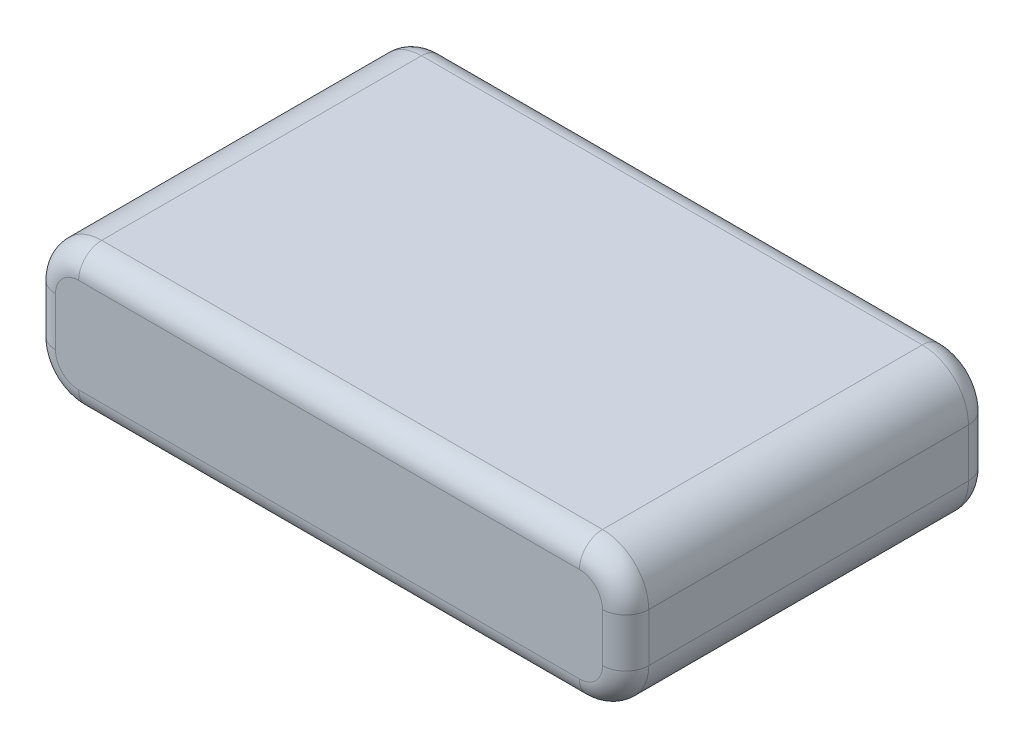
ISO-10303-21;
HEADER;
FILE_DESCRIPTION(('STEP AP214'),'2;1');
FILE_NAME('part.step','',(''),(''),'','','');
FILE_SCHEMA(('AUTOMOTIVE_DESIGN { 1 0 10303 214 1 1 1 1 }'));
ENDSEC;
DATA;
#1=APPLICATION_CONTEXT('core data for automotive mechanical design processes');
#2=APPLICATION_PROTOCOL_DEFINITION('international standard','automotive_design',2000,#1);
#3=PRODUCT_CONTEXT('',#1,'mechanical');
#4=PRODUCT('Part','Part','',(#3));
#5=PRODUCT_RELATED_PRODUCT_CATEGORY('part','',(#4));
#6=PRODUCT_DEFINITION_FORMATION('','',#4);
#7=PRODUCT_DEFINITION_CONTEXT('part definition',#1,'design');
#8=PRODUCT_DEFINITION('design','',#6,#7);
#9=PRODUCT_DEFINITION_SHAPE('','',#8);
#10=(LENGTH_UNIT() NAMED_UNIT(*) SI_UNIT(.MILLI.,.METRE.));
#11=(NAMED_UNIT(*) PLANE_ANGLE_UNIT() SI_UNIT($,.RADIAN.));
#12=(NAMED_UNIT(*) SI_UNIT($,.STERADIAN.) SOLID_ANGLE_UNIT());
#13=UNCERTAINTY_MEASURE_WITH_UNIT(LENGTH_MEASURE(1.E-05),#10,'distance_accuracy_value','');
#14=(GEOMETRIC_REPRESENTATION_CONTEXT(3) GLOBAL_UNCERTAINTY_ASSIGNED_CONTEXT((#13)) GLOBAL_UNIT_ASSIGNED_CONTEXT((#10,
#11,#12)) REPRESENTATION_CONTEXT('',''));
#15=CARTESIAN_POINT('',(0.,0.,0.));
#16=DIRECTION('',(0.,0.,1.));
#17=DIRECTION('',(1.,0.,0.));
#18=AXIS2_PLACEMENT_3D('',#15,#16,#17);
#19=CARTESIAN_POINT('',(19.25,9.15,-11.875));
#20=DIRECTION('',(-1.,0.,0.));
#21=DIRECTION('',(0.,0.,1.));
#22=AXIS2_PLACEMENT_3D('',#19,#20,#21);
#23=PLANE('',#22);
#24=DIRECTION('',(0.,0.,-1.));
#25=VECTOR('',#24,1.);
#26=CARTESIAN_POINT('',(19.25,3.,-11.875));
#27=LINE('',#26,#25);
#28=CARTESIAN_POINT('',(19.25,3.,10.375));
#29=VERTEX_POINT('',#28);
#30=CARTESIAN_POINT('',(19.25,3.,-10.375));
#31=VERTEX_POINT('',#30);
#32=EDGE_CURVE('E169',#29,#31,#27,.T.);
#33=ORIENTED_EDGE('',*,*,#32,.T.);
#34=DIRECTION('',(0.,-1.,0.));
#35=VECTOR('',#34,1.);
#36=CARTESIAN_POINT('',(19.25,9.15,-10.375));
#37=LINE('',#36,#35);
#38=CARTESIAN_POINT('',(19.25,6.15,-10.375));
#39=VERTEX_POINT('',#38);
#40=EDGE_CURVE('E185',#31,#39,#37,.F.);
#41=ORIENTED_EDGE('',*,*,#40,.T.);
#42=DIRECTION('',(0.,0.,-1.));
#43=VECTOR('',#42,1.);
#44=CARTESIAN_POINT('',(19.25,6.15,11.875));
#45=LINE('',#44,#43);
#46=CARTESIAN_POINT('',(19.25,6.15,10.375));
#47=VERTEX_POINT('',#46);
#48=EDGE_CURVE('E298',#39,#47,#45,.F.);
#49=ORIENTED_EDGE('',*,*,#48,.T.);
#50=DIRECTION('',(0.,-1.,0.));
#51=VECTOR('',#50,1.);
#52=CARTESIAN_POINT('',(19.25,9.15,10.375));
#53=LINE('',#52,#51);
#54=EDGE_CURVE('E183',#47,#29,#53,.T.);
#55=ORIENTED_EDGE('',*,*,#54,.T.);
#56=EDGE_LOOP('',(#33,#41,#49,#55));
#57=FACE_BOUND('',#56,.T.);
#58=ADVANCED_FACE('F36',(#57),#23,.F.);
#59=CARTESIAN_POINT('',(-19.25,9.15,-11.875));
#60=DIRECTION('',(0.,0.,1.));
#61=DIRECTION('',(1.,0.,0.));
#62=AXIS2_PLACEMENT_3D('',#59,#60,#61);
#63=PLANE('',#62);
#64=DIRECTION('',(0.,-1.,0.));
#65=VECTOR('',#64,1.);
#66=CARTESIAN_POINT('',(17.75,9.15,-11.875));
#67=LINE('',#66,#65);
#68=CARTESIAN_POINT('',(17.75,6.15,-11.875));
#69=VERTEX_POINT('',#68);
#70=CARTESIAN_POINT('',(17.75,3.,-11.875));
#71=VERTEX_POINT('',#70);
#72=EDGE_CURVE('E173',#69,#71,#67,.T.);
#73=ORIENTED_EDGE('',*,*,#72,.T.);
#74=CARTESIAN_POINT('',(16.25,3.,-11.875));
#75=DIRECTION('',(0.,0.,1.));
#76=DIRECTION('',(1.,0.,0.));
#77=AXIS2_PLACEMENT_3D('',#74,#75,#76);
#78=CIRCLE('',#77,1.5);
#79=CARTESIAN_POINT('',(16.25,1.5,-11.875));
#80=VERTEX_POINT('',#79);
#81=EDGE_CURVE('E154',#71,#80,#78,.F.);
#82=ORIENTED_EDGE('',*,*,#81,.T.);
#83=DIRECTION('',(-1.,0.,0.));
#84=VECTOR('',#83,1.);
#85=CARTESIAN_POINT('',(-19.25,1.5,-11.875));
#86=LINE('',#85,#84);
#87=CARTESIAN_POINT('',(-16.25,1.5,-11.875));
#88=VERTEX_POINT('',#87);
#89=EDGE_CURVE('E162',#80,#88,#86,.T.);
#90=ORIENTED_EDGE('',*,*,#89,.T.);
#91=CARTESIAN_POINT('',(-16.25,3.,-11.875));
#92=DIRECTION('',(0.,0.,1.));
#93=DIRECTION('',(1.,0.,0.));
#94=AXIS2_PLACEMENT_3D('',#91,#92,#93);
#95=CIRCLE('',#94,1.5);
#96=CARTESIAN_POINT('',(-17.75,3.,-11.875));
#97=VERTEX_POINT('',#96);
#98=EDGE_CURVE('E168',#88,#97,#95,.F.);
#99=ORIENTED_EDGE('',*,*,#98,.T.);
#100=DIRECTION('',(0.,-1.,0.));
#101=VECTOR('',#100,1.);
#102=CARTESIAN_POINT('',(-17.75,9.15,-11.875));
#103=LINE('',#102,#101);
#104=CARTESIAN_POINT('',(-17.75,6.15,-11.875));
#105=VERTEX_POINT('',#104);
#106=EDGE_CURVE('E303',#97,#105,#103,.F.);
#107=ORIENTED_EDGE('',*,*,#106,.T.);
#108=CARTESIAN_POINT('',(-16.25,6.15,-11.875));
#109=DIRECTION('',(0.,0.,1.));
#110=DIRECTION('',(1.,0.,0.));
#111=AXIS2_PLACEMENT_3D('',#108,#109,#110);
#112=CIRCLE('',#111,1.5);
#113=CARTESIAN_POINT('',(-16.25,7.65,-11.875));
#114=VERTEX_POINT('',#113);
#115=EDGE_CURVE('E305',#105,#114,#112,.F.);
#116=ORIENTED_EDGE('',*,*,#115,.T.);
#117=DIRECTION('',(-1.,0.,0.));
#118=VECTOR('',#117,1.);
#119=CARTESIAN_POINT('',(16.25,7.65,-11.875));
#120=LINE('',#119,#118);
#121=CARTESIAN_POINT('',(16.25,7.65,-11.875));
#122=VERTEX_POINT('',#121);
#123=EDGE_CURVE('E307',#114,#122,#120,.F.);
#124=ORIENTED_EDGE('',*,*,#123,.T.);
#125=CARTESIAN_POINT('',(16.25,6.15,-11.875));
#126=DIRECTION('',(0.,0.,1.));
#127=DIRECTION('',(1.,0.,0.));
#128=AXIS2_PLACEMENT_3D('',#125,#126,#127);
#129=CIRCLE('',#128,1.5);
#130=EDGE_CURVE('E178',#122,#69,#129,.F.);
#131=ORIENTED_EDGE('',*,*,#130,.T.);
#132=EDGE_LOOP('',(#73,#82,#90,#99,#107,#116,#124,#131));
#133=FACE_BOUND('',#132,.T.);
#134=ADVANCED_FACE('F171',(#133),#63,.F.);
#135=CARTESIAN_POINT('',(-19.25,9.15,-11.875));
#136=DIRECTION('',(1.,0.,0.));
#137=DIRECTION('',(0.,0.,-1.));
#138=AXIS2_PLACEMENT_3D('',#135,#136,#137);
#139=PLANE('',#138);
#140=DIRECTION('',(0.,0.,1.));
#141=VECTOR('',#140,1.);
#142=CARTESIAN_POINT('',(-19.25,6.15,-11.875));
#143=LINE('',#142,#141);
#144=CARTESIAN_POINT('',(-19.25,6.15,10.375));
#145=VERTEX_POINT('',#144);
#146=CARTESIAN_POINT('',(-19.25,6.15,-10.375));
#147=VERTEX_POINT('',#146);
#148=EDGE_CURVE('E241',#145,#147,#143,.F.);
#149=ORIENTED_EDGE('',*,*,#148,.T.);
#150=DIRECTION('',(0.,-1.,0.));
#151=VECTOR('',#150,1.);
#152=CARTESIAN_POINT('',(-19.25,9.15,-10.375));
#153=LINE('',#152,#151);
#154=CARTESIAN_POINT('',(-19.25,3.,-10.375));
#155=VERTEX_POINT('',#154);
#156=EDGE_CURVE('E202',#147,#155,#153,.T.);
#157=ORIENTED_EDGE('',*,*,#156,.T.);
#158=DIRECTION('',(0.,0.,1.));
#159=VECTOR('',#158,1.);
#160=CARTESIAN_POINT('',(-19.25,3.,-11.875));
#161=LINE('',#160,#159);
#162=CARTESIAN_POINT('',(-19.25,3.,10.375));
#163=VERTEX_POINT('',#162);
#164=EDGE_CURVE('E285',#155,#163,#161,.T.);
#165=ORIENTED_EDGE('',*,*,#164,.T.);
#166=DIRECTION('',(0.,-1.,0.));
#167=VECTOR('',#166,1.);
#168=CARTESIAN_POINT('',(-19.25,9.15,10.375));
#169=LINE('',#168,#167);
#170=EDGE_CURVE('E200',#163,#145,#169,.F.);
#171=ORIENTED_EDGE('',*,*,#170,.T.);
#172=EDGE_LOOP('',(#149,#157,#165,#171));
#173=FACE_BOUND('',#172,.T.);
#174=ADVANCED_FACE('F348',(#173),#139,.F.);
#175=CARTESIAN_POINT('',(-19.25,9.15,11.875));
#176=DIRECTION('',(0.,0.,-1.));
#177=DIRECTION('',(-1.,0.,0.));
#178=AXIS2_PLACEMENT_3D('',#175,#176,#177);
#179=PLANE('',#178);
#180=DIRECTION('',(1.,0.,0.));
#181=VECTOR('',#180,1.);
#182=CARTESIAN_POINT('',(-16.25,7.65,11.875));
#183=LINE('',#182,#181);
#184=CARTESIAN_POINT('',(16.25,7.65,11.875));
#185=VERTEX_POINT('',#184);
#186=CARTESIAN_POINT('',(-16.25,7.65,11.875));
#187=VERTEX_POINT('',#186);
#188=EDGE_CURVE('E45',#185,#187,#183,.F.);
#189=ORIENTED_EDGE('',*,*,#188,.T.);
#190=CARTESIAN_POINT('',(-16.25,6.15,11.875));
#191=DIRECTION('',(0.,0.,-1.));
#192=DIRECTION('',(-1.,0.,0.));
#193=AXIS2_PLACEMENT_3D('',#190,#191,#192);
#194=CIRCLE('',#193,1.5);
#195=CARTESIAN_POINT('',(-17.75,6.15,11.875));
#196=VERTEX_POINT('',#195);
#197=EDGE_CURVE('E11',#187,#196,#194,.F.);
#198=ORIENTED_EDGE('',*,*,#197,.T.);
#199=DIRECTION('',(0.,-1.,0.));
#200=VECTOR('',#199,1.);
#201=CARTESIAN_POINT('',(-17.75,9.15,11.875));
#202=LINE('',#201,#200);
#203=CARTESIAN_POINT('',(-17.75,3.,11.875));
#204=VERTEX_POINT('',#203);
#205=EDGE_CURVE('E212',#196,#204,#202,.T.);
#206=ORIENTED_EDGE('',*,*,#205,.T.);
#207=CARTESIAN_POINT('',(-16.25,3.,11.875));
#208=DIRECTION('',(0.,0.,-1.));
#209=DIRECTION('',(-1.,0.,0.));
#210=AXIS2_PLACEMENT_3D('',#207,#208,#209);
#211=CIRCLE('',#210,1.5);
#212=CARTESIAN_POINT('',(-16.25,1.5,11.875));
#213=VERTEX_POINT('',#212);
#214=EDGE_CURVE('E214',#204,#213,#211,.F.);
#215=ORIENTED_EDGE('',*,*,#214,.T.);
#216=DIRECTION('',(1.,0.,0.));
#217=VECTOR('',#216,1.);
#218=CARTESIAN_POINT('',(-19.25,1.5,11.875));
#219=LINE('',#218,#217);
#220=CARTESIAN_POINT('',(16.25,1.5,11.875));
#221=VERTEX_POINT('',#220);
#222=EDGE_CURVE('E216',#213,#221,#219,.T.);
#223=ORIENTED_EDGE('',*,*,#222,.T.);
#224=CARTESIAN_POINT('',(16.25,3.,11.875));
#225=DIRECTION('',(0.,0.,-1.));
#226=DIRECTION('',(-1.,0.,0.));
#227=AXIS2_PLACEMENT_3D('',#224,#225,#226);
#228=CIRCLE('',#227,1.5);
#229=CARTESIAN_POINT('',(17.75,3.,11.875));
#230=VERTEX_POINT('',#229);
#231=EDGE_CURVE('E218',#221,#230,#228,.F.);
#232=ORIENTED_EDGE('',*,*,#231,.T.);
#233=DIRECTION('',(0.,-1.,0.));
#234=VECTOR('',#233,1.);
#235=CARTESIAN_POINT('',(17.75,9.15,11.875));
#236=LINE('',#235,#234);
#237=CARTESIAN_POINT('',(17.75,6.15,11.875));
#238=VERTEX_POINT('',#237);
#239=EDGE_CURVE('E220',#230,#238,#236,.F.);
#240=ORIENTED_EDGE('',*,*,#239,.T.);
#241=CARTESIAN_POINT('',(16.25,6.15,11.875));
#242=DIRECTION('',(0.,0.,-1.));
#243=DIRECTION('',(-1.,0.,0.));
#244=AXIS2_PLACEMENT_3D('',#241,#242,#243);
#245=CIRCLE('',#244,1.5);
#246=EDGE_CURVE('E56',#238,#185,#245,.F.);
#247=ORIENTED_EDGE('',*,*,#246,.T.);
#248=EDGE_LOOP('',(#189,#198,#206,#215,#223,#232,#240,#247));
#249=FACE_BOUND('',#248,.T.);
#250=ADVANCED_FACE('F335',(#249),#179,.F.);
#251=CARTESIAN_POINT('',(0.,9.15,0.));
#252=DIRECTION('',(0.,1.,0.));
#253=DIRECTION('',(0.,0.,1.));
#254=AXIS2_PLACEMENT_3D('',#251,#252,#253);
#255=PLANE('',#254);
#256=DIRECTION('',(0.,0.,-1.));
#257=VECTOR('',#256,1.);
#258=CARTESIAN_POINT('',(16.25,9.15,-11.875));
#259=LINE('',#258,#257);
#260=CARTESIAN_POINT('',(16.25,9.15,10.375));
#261=VERTEX_POINT('',#260);
#262=CARTESIAN_POINT('',(16.25,9.15,-10.375));
#263=VERTEX_POINT('',#262);
#264=EDGE_CURVE('E287',#261,#263,#259,.T.);
#265=ORIENTED_EDGE('',*,*,#264,.T.);
#266=DIRECTION('',(-1.,0.,0.));
#267=VECTOR('',#266,1.);
#268=CARTESIAN_POINT('',(-16.25,9.15,-10.375));
#269=LINE('',#268,#267);
#270=CARTESIAN_POINT('',(-16.25,9.15,-10.375));
#271=VERTEX_POINT('',#270);
#272=EDGE_CURVE('E193',#263,#271,#269,.T.);
#273=ORIENTED_EDGE('',*,*,#272,.T.);
#274=DIRECTION('',(0.,0.,1.));
#275=VECTOR('',#274,1.);
#276=CARTESIAN_POINT('',(-16.25,9.15,11.875));
#277=LINE('',#276,#275);
#278=CARTESIAN_POINT('',(-16.25,9.15,10.375));
#279=VERTEX_POINT('',#278);
#280=EDGE_CURVE('E295',#271,#279,#277,.T.);
#281=ORIENTED_EDGE('',*,*,#280,.T.);
#282=DIRECTION('',(1.,0.,0.));
#283=VECTOR('',#282,1.);
#284=CARTESIAN_POINT('',(16.25,9.15,10.375));
#285=LINE('',#284,#283);
#286=EDGE_CURVE('E191',#279,#261,#285,.T.);
#287=ORIENTED_EDGE('',*,*,#286,.T.);
#288=EDGE_LOOP('',(#265,#273,#281,#287));
#289=FACE_BOUND('',#288,.T.);
#290=ADVANCED_FACE('F364',(#289),#255,.T.);
#291=CARTESIAN_POINT('',(0.,0.,0.));
#292=DIRECTION('',(0.,1.,0.));
#293=DIRECTION('',(0.,0.,1.));
#294=AXIS2_PLACEMENT_3D('',#291,#292,#293);
#295=PLANE('',#294);
#296=DIRECTION('',(0.,0.,1.));
#297=VECTOR('',#296,1.);
#298=CARTESIAN_POINT('',(-16.25,0.,0.));
#299=LINE('',#298,#297);
#300=CARTESIAN_POINT('',(-16.25,0.,10.375));
#301=VERTEX_POINT('',#300);
#302=CARTESIAN_POINT('',(-16.25,0.,-10.375));
#303=VERTEX_POINT('',#302);
#304=EDGE_CURVE('E284',#301,#303,#299,.F.);
#305=ORIENTED_EDGE('',*,*,#304,.T.);
#306=DIRECTION('',(-1.,0.,0.));
#307=VECTOR('',#306,1.);
#308=CARTESIAN_POINT('',(0.,0.,-10.375));
#309=LINE('',#308,#307);
#310=CARTESIAN_POINT('',(16.25,0.,-10.375));
#311=VERTEX_POINT('',#310);
#312=EDGE_CURVE('E210',#303,#311,#309,.F.);
#313=ORIENTED_EDGE('',*,*,#312,.T.);
#314=DIRECTION('',(0.,0.,-1.));
#315=VECTOR('',#314,1.);
#316=CARTESIAN_POINT('',(16.25,0.,0.));
#317=LINE('',#316,#315);
#318=CARTESIAN_POINT('',(16.25,0.,10.375));
#319=VERTEX_POINT('',#318);
#320=EDGE_CURVE('E278',#311,#319,#317,.F.);
#321=ORIENTED_EDGE('',*,*,#320,.T.);
#322=DIRECTION('',(1.,0.,0.));
#323=VECTOR('',#322,1.);
#324=CARTESIAN_POINT('',(0.,0.,10.375));
#325=LINE('',#324,#323);
#326=EDGE_CURVE('E208',#319,#301,#325,.F.);
#327=ORIENTED_EDGE('',*,*,#326,.T.);
#328=EDGE_LOOP('',(#305,#313,#321,#327));
#329=FACE_BOUND('',#328,.T.);
#330=ADVANCED_FACE('F282',(#329),#295,.F.);
#331=CARTESIAN_POINT('',(-16.25,3.,-11.875));
#332=DIRECTION('',(0.,0.,1.));
#333=DIRECTION('',(1.,0.,0.));
#334=AXIS2_PLACEMENT_3D('',#331,#332,#333);
#335=CYLINDRICAL_SURFACE('',#334,3.);
#336=ORIENTED_EDGE('',*,*,#164,.F.);
#337=CARTESIAN_POINT('',(-16.25,3.,-10.375));
#338=DIRECTION('',(0.,0.,1.));
#339=DIRECTION('',(1.,0.,0.));
#340=AXIS2_PLACEMENT_3D('',#337,#338,#339);
#341=CIRCLE('',#340,3.);
#342=EDGE_CURVE('E206',#155,#303,#341,.T.);
#343=ORIENTED_EDGE('',*,*,#342,.T.);
#344=ORIENTED_EDGE('',*,*,#304,.F.);
#345=CARTESIAN_POINT('',(-16.25,3.,10.375));
#346=DIRECTION('',(0.,0.,-1.));
#347=DIRECTION('',(-1.,0.,0.));
#348=AXIS2_PLACEMENT_3D('',#345,#346,#347);
#349=CIRCLE('',#348,3.);
#350=EDGE_CURVE('E204',#301,#163,#349,.T.);
#351=ORIENTED_EDGE('',*,*,#350,.T.);
#352=EDGE_LOOP('',(#336,#343,#344,#351));
#353=FACE_BOUND('',#352,.T.);
#354=ADVANCED_FACE('F371',(#353),#335,.T.);
#355=CARTESIAN_POINT('',(-16.25,6.15,0.));
#356=DIRECTION('',(0.,0.,-1.));
#357=DIRECTION('',(-1.,0.,0.));
#358=AXIS2_PLACEMENT_3D('',#355,#356,#357);
#359=CYLINDRICAL_SURFACE('',#358,3.);
#360=ORIENTED_EDGE('',*,*,#280,.F.);
#361=CARTESIAN_POINT('',(-16.25,6.15,-10.375));
#362=DIRECTION('',(0.,0.,1.));
#363=DIRECTION('',(1.,0.,0.));
#364=AXIS2_PLACEMENT_3D('',#361,#362,#363);
#365=CIRCLE('',#364,3.);
#366=EDGE_CURVE('E198',#271,#147,#365,.T.);
#367=ORIENTED_EDGE('',*,*,#366,.T.);
#368=ORIENTED_EDGE('',*,*,#148,.F.);
#369=CARTESIAN_POINT('',(-16.25,6.15,10.375));
#370=DIRECTION('',(0.,0.,-1.));
#371=DIRECTION('',(-1.,0.,0.));
#372=AXIS2_PLACEMENT_3D('',#369,#370,#371);
#373=CIRCLE('',#372,3.);
#374=EDGE_CURVE('E195',#145,#279,#373,.T.);
#375=ORIENTED_EDGE('',*,*,#374,.T.);
#376=EDGE_LOOP('',(#360,#367,#368,#375));
#377=FACE_BOUND('',#376,.T.);
#378=ADVANCED_FACE('F353',(#377),#359,.T.);
#379=CARTESIAN_POINT('',(16.25,3.,-11.875));
#380=DIRECTION('',(0.,0.,-1.));
#381=DIRECTION('',(-1.,0.,0.));
#382=AXIS2_PLACEMENT_3D('',#379,#380,#381);
#383=CYLINDRICAL_SURFACE('',#382,3.);
#384=ORIENTED_EDGE('',*,*,#320,.F.);
#385=CARTESIAN_POINT('',(16.25,3.,-10.375));
#386=DIRECTION('',(0.,0.,1.));
#387=DIRECTION('',(1.,0.,0.));
#388=AXIS2_PLACEMENT_3D('',#385,#386,#387);
#389=CIRCLE('',#388,3.);
#390=EDGE_CURVE('E156',#311,#31,#389,.T.);
#391=ORIENTED_EDGE('',*,*,#390,.T.);
#392=ORIENTED_EDGE('',*,*,#32,.F.);
#393=CARTESIAN_POINT('',(16.25,3.,10.375));
#394=DIRECTION('',(0.,0.,-1.));
#395=DIRECTION('',(-1.,0.,0.));
#396=AXIS2_PLACEMENT_3D('',#393,#394,#395);
#397=CIRCLE('',#396,3.);
#398=EDGE_CURVE('E175',#29,#319,#397,.T.);
#399=ORIENTED_EDGE('',*,*,#398,.T.);
#400=EDGE_LOOP('',(#384,#391,#392,#399));
#401=FACE_BOUND('',#400,.T.);
#402=ADVANCED_FACE('F277',(#401),#383,.T.);
#403=CARTESIAN_POINT('',(16.25,6.15,0.));
#404=DIRECTION('',(0.,0.,1.));
#405=DIRECTION('',(1.,0.,0.));
#406=AXIS2_PLACEMENT_3D('',#403,#404,#405);
#407=CYLINDRICAL_SURFACE('',#406,3.);
#408=ORIENTED_EDGE('',*,*,#48,.F.);
#409=CARTESIAN_POINT('',(16.25,6.15,-10.375));
#410=DIRECTION('',(0.,0.,1.));
#411=DIRECTION('',(1.,0.,0.));
#412=AXIS2_PLACEMENT_3D('',#409,#410,#411);
#413=CIRCLE('',#412,3.);
#414=EDGE_CURVE('E189',#39,#263,#413,.T.);
#415=ORIENTED_EDGE('',*,*,#414,.T.);
#416=ORIENTED_EDGE('',*,*,#264,.F.);
#417=CARTESIAN_POINT('',(16.25,6.15,10.375));
#418=DIRECTION('',(0.,0.,-1.));
#419=DIRECTION('',(-1.,0.,0.));
#420=AXIS2_PLACEMENT_3D('',#417,#418,#419);
#421=CIRCLE('',#420,3.);
#422=EDGE_CURVE('E187',#261,#47,#421,.T.);
#423=ORIENTED_EDGE('',*,*,#422,.T.);
#424=EDGE_LOOP('',(#408,#415,#416,#423));
#425=FACE_BOUND('',#424,.T.);
#426=ADVANCED_FACE('F321',(#425),#407,.T.);
#427=CARTESIAN_POINT('',(-16.25,6.15,-10.375));
#428=DIRECTION('',(0.,0.,1.));
#429=DIRECTION('',(1.,0.,0.));
#430=AXIS2_PLACEMENT_3D('',#427,#428,#429);
#431=DEGENERATE_TOROIDAL_SURFACE('',#430,1.5,1.5,.T.);
#432=CARTESIAN_POINT('',(-17.75,6.15,-10.375));
#433=DIRECTION('',(0.,-1.,0.));
#434=DIRECTION('',(0.,0.,-1.));
#435=AXIS2_PLACEMENT_3D('',#432,#433,#434);
#436=CIRCLE('',#435,1.5);
#437=EDGE_CURVE('E235',#147,#105,#436,.T.);
#438=ORIENTED_EDGE('',*,*,#437,.F.);
#439=ORIENTED_EDGE('',*,*,#366,.F.);
#440=CARTESIAN_POINT('',(-16.25,7.65,-10.375));
#441=DIRECTION('',(1.,0.,0.));
#442=DIRECTION('',(0.,0.,-1.));
#443=AXIS2_PLACEMENT_3D('',#440,#441,#442);
#444=CIRCLE('',#443,1.5);
#445=EDGE_CURVE('E238',#114,#271,#444,.T.);
#446=ORIENTED_EDGE('',*,*,#445,.F.);
#447=ORIENTED_EDGE('',*,*,#115,.F.);
#448=EDGE_LOOP('',(#438,#439,#446,#447));
#449=FACE_BOUND('',#448,.T.);
#450=ADVANCED_FACE('F357',(#449),#431,.T.);
#451=CARTESIAN_POINT('',(0.,7.65,-10.375));
#452=DIRECTION('',(1.,0.,0.));
#453=DIRECTION('',(0.,0.,-1.));
#454=AXIS2_PLACEMENT_3D('',#451,#452,#453);
#455=CYLINDRICAL_SURFACE('',#454,1.5);
#456=ORIENTED_EDGE('',*,*,#445,.T.);
#457=ORIENTED_EDGE('',*,*,#272,.F.);
#458=CARTESIAN_POINT('',(16.25,7.65,-10.375));
#459=DIRECTION('',(1.,0.,0.));
#460=DIRECTION('',(0.,0.,-1.));
#461=AXIS2_PLACEMENT_3D('',#458,#459,#460);
#462=CIRCLE('',#461,1.5);
#463=EDGE_CURVE('E232',#122,#263,#462,.T.);
#464=ORIENTED_EDGE('',*,*,#463,.F.);
#465=ORIENTED_EDGE('',*,*,#123,.F.);
#466=EDGE_LOOP('',(#456,#457,#464,#465));
#467=FACE_BOUND('',#466,.T.);
#468=ADVANCED_FACE('F362',(#467),#455,.T.);
#469=CARTESIAN_POINT('',(-17.75,9.15,-10.375));
#470=DIRECTION('',(0.,-1.,0.));
#471=DIRECTION('',(0.,0.,-1.));
#472=AXIS2_PLACEMENT_3D('',#469,#470,#471);
#473=CYLINDRICAL_SURFACE('',#472,1.5);
#474=ORIENTED_EDGE('',*,*,#437,.T.);
#475=ORIENTED_EDGE('',*,*,#106,.F.);
#476=CARTESIAN_POINT('',(-17.75,3.,-10.375));
#477=DIRECTION('',(0.,-1.,0.));
#478=DIRECTION('',(0.,0.,-1.));
#479=AXIS2_PLACEMENT_3D('',#476,#477,#478);
#480=CIRCLE('',#479,1.5);
#481=EDGE_CURVE('E229',#155,#97,#480,.T.);
#482=ORIENTED_EDGE('',*,*,#481,.F.);
#483=ORIENTED_EDGE('',*,*,#156,.F.);
#484=EDGE_LOOP('',(#474,#475,#482,#483));
#485=FACE_BOUND('',#484,.T.);
#486=ADVANCED_FACE('F403',(#485),#473,.T.);
#487=CARTESIAN_POINT('',(16.25,6.15,-10.375));
#488=DIRECTION('',(0.,0.,1.));
#489=DIRECTION('',(1.,0.,0.));
#490=AXIS2_PLACEMENT_3D('',#487,#488,#489);
#491=DEGENERATE_TOROIDAL_SURFACE('',#490,1.5,1.5,.T.);
#492=ORIENTED_EDGE('',*,*,#463,.T.);
#493=ORIENTED_EDGE('',*,*,#414,.F.);
#494=CARTESIAN_POINT('',(17.75,6.15,-10.375));
#495=DIRECTION('',(0.,-1.,0.));
#496=DIRECTION('',(0.,0.,-1.));
#497=AXIS2_PLACEMENT_3D('',#494,#495,#496);
#498=CIRCLE('',#497,1.5);
#499=EDGE_CURVE('E226',#69,#39,#498,.T.);
#500=ORIENTED_EDGE('',*,*,#499,.F.);
#501=ORIENTED_EDGE('',*,*,#130,.F.);
#502=EDGE_LOOP('',(#492,#493,#500,#501));
#503=FACE_BOUND('',#502,.T.);
#504=ADVANCED_FACE('F314',(#503),#491,.T.);
#505=CARTESIAN_POINT('',(-16.25,3.,-10.375));
#506=DIRECTION('',(0.,0.,1.));
#507=DIRECTION('',(1.,0.,0.));
#508=AXIS2_PLACEMENT_3D('',#505,#506,#507);
#509=DEGENERATE_TOROIDAL_SURFACE('',#508,1.5,1.5,.T.);
#510=ORIENTED_EDGE('',*,*,#481,.T.);
#511=ORIENTED_EDGE('',*,*,#98,.F.);
#512=CARTESIAN_POINT('',(-16.25,1.5,-10.375));
#513=DIRECTION('',(1.,0.,0.));
#514=DIRECTION('',(0.,0.,-1.));
#515=AXIS2_PLACEMENT_3D('',#512,#513,#514);
#516=CIRCLE('',#515,1.5);
#517=EDGE_CURVE('E165',#303,#88,#516,.T.);
#518=ORIENTED_EDGE('',*,*,#517,.F.);
#519=ORIENTED_EDGE('',*,*,#342,.F.);
#520=EDGE_LOOP('',(#510,#511,#518,#519));
#521=FACE_BOUND('',#520,.T.);
#522=ADVANCED_FACE('F397',(#521),#509,.T.);
#523=CARTESIAN_POINT('',(17.75,9.15,-10.375));
#524=DIRECTION('',(0.,-1.,0.));
#525=DIRECTION('',(0.,0.,-1.));
#526=AXIS2_PLACEMENT_3D('',#523,#524,#525);
#527=CYLINDRICAL_SURFACE('',#526,1.5);
#528=ORIENTED_EDGE('',*,*,#499,.T.);
#529=ORIENTED_EDGE('',*,*,#40,.F.);
#530=CARTESIAN_POINT('',(17.75,3.,-10.375));
#531=DIRECTION('',(0.,-1.,0.));
#532=DIRECTION('',(0.,0.,-1.));
#533=AXIS2_PLACEMENT_3D('',#530,#531,#532);
#534=CIRCLE('',#533,1.5);
#535=EDGE_CURVE('E159',#71,#31,#534,.T.);
#536=ORIENTED_EDGE('',*,*,#535,.F.);
#537=ORIENTED_EDGE('',*,*,#72,.F.);
#538=EDGE_LOOP('',(#528,#529,#536,#537));
#539=FACE_BOUND('',#538,.T.);
#540=ADVANCED_FACE('F317',(#539),#527,.T.);
#541=CARTESIAN_POINT('',(-19.25,1.5,-10.375));
#542=DIRECTION('',(-1.,0.,0.));
#543=DIRECTION('',(0.,0.,1.));
#544=AXIS2_PLACEMENT_3D('',#541,#542,#543);
#545=CYLINDRICAL_SURFACE('',#544,1.5);
#546=ORIENTED_EDGE('',*,*,#517,.T.);
#547=ORIENTED_EDGE('',*,*,#89,.F.);
#548=CARTESIAN_POINT('',(16.25,1.5,-10.375));
#549=DIRECTION('',(1.,0.,0.));
#550=DIRECTION('',(0.,0.,-1.));
#551=AXIS2_PLACEMENT_3D('',#548,#549,#550);
#552=CIRCLE('',#551,1.5);
#553=EDGE_CURVE('E150',#311,#80,#552,.T.);
#554=ORIENTED_EDGE('',*,*,#553,.F.);
#555=ORIENTED_EDGE('',*,*,#312,.F.);
#556=EDGE_LOOP('',(#546,#547,#554,#555));
#557=FACE_BOUND('',#556,.T.);
#558=ADVANCED_FACE('F163',(#557),#545,.T.);
#559=CARTESIAN_POINT('',(16.25,3.,-10.375));
#560=DIRECTION('',(0.,0.,1.));
#561=DIRECTION('',(1.,0.,0.));
#562=AXIS2_PLACEMENT_3D('',#559,#560,#561);
#563=DEGENERATE_TOROIDAL_SURFACE('',#562,1.5,1.5,.T.);
#564=ORIENTED_EDGE('',*,*,#535,.T.);
#565=ORIENTED_EDGE('',*,*,#390,.F.);
#566=ORIENTED_EDGE('',*,*,#553,.T.);
#567=ORIENTED_EDGE('',*,*,#81,.F.);
#568=EDGE_LOOP('',(#564,#565,#566,#567));
#569=FACE_BOUND('',#568,.T.);
#570=ADVANCED_FACE('F152',(#569),#563,.T.);
#571=CARTESIAN_POINT('',(16.25,3.,10.375));
#572=DIRECTION('',(0.,0.,-1.));
#573=DIRECTION('',(-1.,0.,0.));
#574=AXIS2_PLACEMENT_3D('',#571,#572,#573);
#575=DEGENERATE_TOROIDAL_SURFACE('',#574,1.5,1.5,.T.);
#576=CARTESIAN_POINT('',(16.25,1.5,10.375));
#577=DIRECTION('',(-1.,0.,0.));
#578=DIRECTION('',(0.,0.,1.));
#579=AXIS2_PLACEMENT_3D('',#576,#577,#578);
#580=CIRCLE('',#579,1.5);
#581=EDGE_CURVE('E257',#319,#221,#580,.T.);
#582=ORIENTED_EDGE('',*,*,#581,.F.);
#583=ORIENTED_EDGE('',*,*,#398,.F.);
#584=CARTESIAN_POINT('',(17.75,3.,10.375));
#585=DIRECTION('',(0.,1.,0.));
#586=DIRECTION('',(0.,0.,1.));
#587=AXIS2_PLACEMENT_3D('',#584,#585,#586);
#588=CIRCLE('',#587,1.5);
#589=EDGE_CURVE('E40',#230,#29,#588,.T.);
#590=ORIENTED_EDGE('',*,*,#589,.F.);
#591=ORIENTED_EDGE('',*,*,#231,.F.);
#592=EDGE_LOOP('',(#582,#583,#590,#591));
#593=FACE_BOUND('',#592,.T.);
#594=ADVANCED_FACE('F38',(#593),#575,.T.);
#595=CARTESIAN_POINT('',(17.75,9.15,10.375));
#596=DIRECTION('',(0.,-1.,0.));
#597=DIRECTION('',(0.,0.,-1.));
#598=AXIS2_PLACEMENT_3D('',#595,#596,#597);
#599=CYLINDRICAL_SURFACE('',#598,1.5);
#600=ORIENTED_EDGE('',*,*,#589,.T.);
#601=ORIENTED_EDGE('',*,*,#54,.F.);
#602=CARTESIAN_POINT('',(17.75,6.15,10.375));
#603=DIRECTION('',(0.,1.,0.));
#604=DIRECTION('',(0.,0.,1.));
#605=AXIS2_PLACEMENT_3D('',#602,#603,#604);
#606=CIRCLE('',#605,1.5);
#607=EDGE_CURVE('E255',#238,#47,#606,.T.);
#608=ORIENTED_EDGE('',*,*,#607,.F.);
#609=ORIENTED_EDGE('',*,*,#239,.F.);
#610=EDGE_LOOP('',(#600,#601,#608,#609));
#611=FACE_BOUND('',#610,.T.);
#612=ADVANCED_FACE('F268',(#611),#599,.T.);
#613=CARTESIAN_POINT('',(-19.25,1.5,10.375));
#614=DIRECTION('',(1.,0.,0.));
#615=DIRECTION('',(0.,0.,-1.));
#616=AXIS2_PLACEMENT_3D('',#613,#614,#615);
#617=CYLINDRICAL_SURFACE('',#616,1.5);
#618=ORIENTED_EDGE('',*,*,#581,.T.);
#619=ORIENTED_EDGE('',*,*,#222,.F.);
#620=CARTESIAN_POINT('',(-16.25,1.5,10.375));
#621=DIRECTION('',(-1.,0.,0.));
#622=DIRECTION('',(0.,0.,1.));
#623=AXIS2_PLACEMENT_3D('',#620,#621,#622);
#624=CIRCLE('',#623,1.5);
#625=EDGE_CURVE('E252',#301,#213,#624,.T.);
#626=ORIENTED_EDGE('',*,*,#625,.F.);
#627=ORIENTED_EDGE('',*,*,#326,.F.);
#628=EDGE_LOOP('',(#618,#619,#626,#627));
#629=FACE_BOUND('',#628,.T.);
#630=ADVANCED_FACE('F421',(#629),#617,.T.);
#631=CARTESIAN_POINT('',(16.25,6.15,10.375));
#632=DIRECTION('',(0.,0.,-1.));
#633=DIRECTION('',(-1.,0.,0.));
#634=AXIS2_PLACEMENT_3D('',#631,#632,#633);
#635=DEGENERATE_TOROIDAL_SURFACE('',#634,1.5,1.5,.T.);
#636=ORIENTED_EDGE('',*,*,#607,.T.);
#637=ORIENTED_EDGE('',*,*,#422,.F.);
#638=CARTESIAN_POINT('',(16.25,7.65,10.375));
#639=DIRECTION('',(-1.,0.,0.));
#640=DIRECTION('',(0.,0.,1.));
#641=AXIS2_PLACEMENT_3D('',#638,#639,#640);
#642=CIRCLE('',#641,1.5);
#643=EDGE_CURVE('E249',#185,#261,#642,.T.);
#644=ORIENTED_EDGE('',*,*,#643,.F.);
#645=ORIENTED_EDGE('',*,*,#246,.F.);
#646=EDGE_LOOP('',(#636,#637,#644,#645));
#647=FACE_BOUND('',#646,.T.);
#648=ADVANCED_FACE('F325',(#647),#635,.T.);
#649=CARTESIAN_POINT('',(-16.25,3.,10.375));
#650=DIRECTION('',(0.,0.,-1.));
#651=DIRECTION('',(-1.,0.,0.));
#652=AXIS2_PLACEMENT_3D('',#649,#650,#651);
#653=DEGENERATE_TOROIDAL_SURFACE('',#652,1.5,1.5,.T.);
#654=ORIENTED_EDGE('',*,*,#625,.T.);
#655=ORIENTED_EDGE('',*,*,#214,.F.);
#656=CARTESIAN_POINT('',(-17.75,3.,10.375));
#657=DIRECTION('',(0.,1.,0.));
#658=DIRECTION('',(0.,0.,1.));
#659=AXIS2_PLACEMENT_3D('',#656,#657,#658);
#660=CIRCLE('',#659,1.5);
#661=EDGE_CURVE('E246',#163,#204,#660,.T.);
#662=ORIENTED_EDGE('',*,*,#661,.F.);
#663=ORIENTED_EDGE('',*,*,#350,.F.);
#664=EDGE_LOOP('',(#654,#655,#662,#663));
#665=FACE_BOUND('',#664,.T.);
#666=ADVANCED_FACE('F340',(#665),#653,.T.);
#667=CARTESIAN_POINT('',(0.,7.65,10.375));
#668=DIRECTION('',(-1.,0.,0.));
#669=DIRECTION('',(0.,0.,1.));
#670=AXIS2_PLACEMENT_3D('',#667,#668,#669);
#671=CYLINDRICAL_SURFACE('',#670,1.5);
#672=ORIENTED_EDGE('',*,*,#643,.T.);
#673=ORIENTED_EDGE('',*,*,#286,.F.);
#674=CARTESIAN_POINT('',(-16.25,7.65,10.375));
#675=DIRECTION('',(-1.,0.,0.));
#676=DIRECTION('',(0.,0.,1.));
#677=AXIS2_PLACEMENT_3D('',#674,#675,#676);
#678=CIRCLE('',#677,1.5);
#679=EDGE_CURVE('E244',#187,#279,#678,.T.);
#680=ORIENTED_EDGE('',*,*,#679,.F.);
#681=ORIENTED_EDGE('',*,*,#188,.F.);
#682=EDGE_LOOP('',(#672,#673,#680,#681));
#683=FACE_BOUND('',#682,.T.);
#684=ADVANCED_FACE('F328',(#683),#671,.T.);
#685=CARTESIAN_POINT('',(-17.75,9.15,10.375));
#686=DIRECTION('',(0.,-1.,0.));
#687=DIRECTION('',(0.,0.,-1.));
#688=AXIS2_PLACEMENT_3D('',#685,#686,#687);
#689=CYLINDRICAL_SURFACE('',#688,1.5);
#690=ORIENTED_EDGE('',*,*,#661,.T.);
#691=ORIENTED_EDGE('',*,*,#205,.F.);
#692=CARTESIAN_POINT('',(-17.75,6.15,10.375));
#693=DIRECTION('',(0.,1.,0.));
#694=DIRECTION('',(0.,0.,1.));
#695=AXIS2_PLACEMENT_3D('',#692,#693,#694);
#696=CIRCLE('',#695,1.5);
#697=EDGE_CURVE('E242',#145,#196,#696,.T.);
#698=ORIENTED_EDGE('',*,*,#697,.F.);
#699=ORIENTED_EDGE('',*,*,#170,.F.);
#700=EDGE_LOOP('',(#690,#691,#698,#699));
#701=FACE_BOUND('',#700,.T.);
#702=ADVANCED_FACE('F344',(#701),#689,.T.);
#703=CARTESIAN_POINT('',(-16.25,6.15,10.375));
#704=DIRECTION('',(0.,0.,-1.));
#705=DIRECTION('',(-1.,0.,0.));
#706=AXIS2_PLACEMENT_3D('',#703,#704,#705);
#707=DEGENERATE_TOROIDAL_SURFACE('',#706,1.5,1.5,.T.);
#708=ORIENTED_EDGE('',*,*,#679,.T.);
#709=ORIENTED_EDGE('',*,*,#374,.F.);
#710=ORIENTED_EDGE('',*,*,#697,.T.);
#711=ORIENTED_EDGE('',*,*,#197,.F.);
#712=EDGE_LOOP('',(#708,#709,#710,#711));
#713=FACE_BOUND('',#712,.T.);
#714=ADVANCED_FACE('F332',(#713),#707,.T.);
#715=CLOSED_SHELL('',(#58,#134,#174,#250,#290,#330,#354,#378,#402,#426,#450,#468,#486,#504,#522,
#540,#558,#570,#594,#612,#630,#648,#666,#684,#702,#714));
#716=MANIFOLD_SOLID_BREP('B2',#715);
#717=ADVANCED_BREP_SHAPE_REPRESENTATION('',(#18,#716),#14);
#718=SHAPE_DEFINITION_REPRESENTATION(#9,#717);
ENDSEC;
END-ISO-10303-21;
